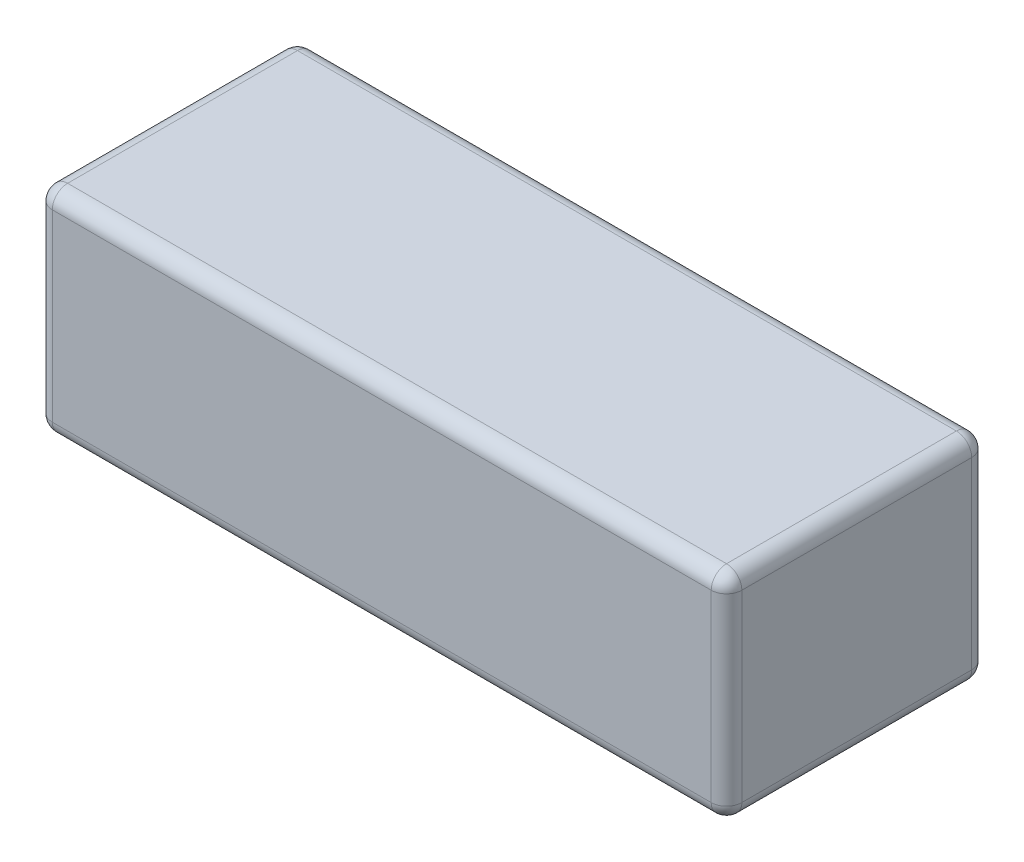
ISO-10303-21;
HEADER;
FILE_DESCRIPTION(('STEP AP214'),'2;1');
FILE_NAME('part.step','',(''),(''),'','','');
FILE_SCHEMA(('AUTOMOTIVE_DESIGN { 1 0 10303 214 1 1 1 1 }'));
ENDSEC;
DATA;
#1=APPLICATION_CONTEXT('core data for automotive mechanical design processes');
#2=APPLICATION_PROTOCOL_DEFINITION('international standard','automotive_design',2000,#1);
#3=PRODUCT_CONTEXT('',#1,'mechanical');
#4=PRODUCT('Part','Part','',(#3));
#5=PRODUCT_RELATED_PRODUCT_CATEGORY('part','',(#4));
#6=PRODUCT_DEFINITION_FORMATION('','',#4);
#7=PRODUCT_DEFINITION_CONTEXT('part definition',#1,'design');
#8=PRODUCT_DEFINITION('design','',#6,#7);
#9=PRODUCT_DEFINITION_SHAPE('','',#8);
#10=(LENGTH_UNIT() NAMED_UNIT(*) SI_UNIT(.MILLI.,.METRE.));
#11=(NAMED_UNIT(*) PLANE_ANGLE_UNIT() SI_UNIT($,.RADIAN.));
#12=(NAMED_UNIT(*) SI_UNIT($,.STERADIAN.) SOLID_ANGLE_UNIT());
#13=UNCERTAINTY_MEASURE_WITH_UNIT(LENGTH_MEASURE(1.E-05),#10,'distance_accuracy_value','');
#14=(GEOMETRIC_REPRESENTATION_CONTEXT(3) GLOBAL_UNCERTAINTY_ASSIGNED_CONTEXT((#13)) GLOBAL_UNIT_ASSIGNED_CONTEXT((#10,
#11,#12)) REPRESENTATION_CONTEXT('',''));
#15=CARTESIAN_POINT('',(0.,0.,0.));
#16=DIRECTION('',(0.,0.,1.));
#17=DIRECTION('',(1.,0.,0.));
#18=AXIS2_PLACEMENT_3D('',#15,#16,#17);
#19=CARTESIAN_POINT('',(45.,28.,-17.));
#20=DIRECTION('',(-1.,0.,0.));
#21=DIRECTION('',(0.,0.,1.));
#22=AXIS2_PLACEMENT_3D('',#19,#20,#21);
#23=PLANE('',#22);
#24=DIRECTION('',(0.,0.,-1.));
#25=VECTOR('',#24,1.);
#26=CARTESIAN_POINT('',(45.,26.,17.));
#27=LINE('',#26,#25);
#28=CARTESIAN_POINT('',(45.,26.,-15.));
#29=VERTEX_POINT('',#28);
#30=CARTESIAN_POINT('',(45.,26.,15.));
#31=VERTEX_POINT('',#30);
#32=EDGE_CURVE('E140',#29,#31,#27,.F.);
#33=ORIENTED_EDGE('',*,*,#32,.T.);
#34=DIRECTION('',(0.,-1.,0.));
#35=VECTOR('',#34,1.);
#36=CARTESIAN_POINT('',(45.,28.,15.));
#37=LINE('',#36,#35);
#38=CARTESIAN_POINT('',(45.,2.,15.));
#39=VERTEX_POINT('',#38);
#40=EDGE_CURVE('E135',#31,#39,#37,.T.);
#41=ORIENTED_EDGE('',*,*,#40,.T.);
#42=DIRECTION('',(0.,0.,-1.));
#43=VECTOR('',#42,1.);
#44=CARTESIAN_POINT('',(45.,2.,-17.));
#45=LINE('',#44,#43);
#46=CARTESIAN_POINT('',(45.,2.,-15.));
#47=VERTEX_POINT('',#46);
#48=EDGE_CURVE('E130',#39,#47,#45,.T.);
#49=ORIENTED_EDGE('',*,*,#48,.T.);
#50=DIRECTION('',(0.,-1.,0.));
#51=VECTOR('',#50,1.);
#52=CARTESIAN_POINT('',(45.,28.,-15.));
#53=LINE('',#52,#51);
#54=EDGE_CURVE('E132',#47,#29,#53,.F.);
#55=ORIENTED_EDGE('',*,*,#54,.T.);
#56=EDGE_LOOP('',(#33,#41,#49,#55));
#57=FACE_BOUND('',#56,.T.);
#58=ADVANCED_FACE('F40',(#57),#23,.F.);
#59=CARTESIAN_POINT('',(-45.,28.,-17.));
#60=DIRECTION('',(0.,0.,1.));
#61=DIRECTION('',(1.,0.,0.));
#62=AXIS2_PLACEMENT_3D('',#59,#60,#61);
#63=PLANE('',#62);
#64=DIRECTION('',(-1.,0.,0.));
#65=VECTOR('',#64,1.);
#66=CARTESIAN_POINT('',(45.,26.,-17.));
#67=LINE('',#66,#65);
#68=CARTESIAN_POINT('',(-43.,26.,-17.));
#69=VERTEX_POINT('',#68);
#70=CARTESIAN_POINT('',(43.,26.,-17.));
#71=VERTEX_POINT('',#70);
#72=EDGE_CURVE('E50',#69,#71,#67,.F.);
#73=ORIENTED_EDGE('',*,*,#72,.T.);
#74=DIRECTION('',(0.,-1.,0.));
#75=VECTOR('',#74,1.);
#76=CARTESIAN_POINT('',(43.,28.,-17.));
#77=LINE('',#76,#75);
#78=CARTESIAN_POINT('',(43.,2.,-17.));
#79=VERTEX_POINT('',#78);
#80=EDGE_CURVE('E11',#71,#79,#77,.T.);
#81=ORIENTED_EDGE('',*,*,#80,.T.);
#82=DIRECTION('',(-1.,0.,0.));
#83=VECTOR('',#82,1.);
#84=CARTESIAN_POINT('',(-45.,2.,-17.));
#85=LINE('',#84,#83);
#86=CARTESIAN_POINT('',(-43.,2.,-17.));
#87=VERTEX_POINT('',#86);
#88=EDGE_CURVE('E250',#79,#87,#85,.T.);
#89=ORIENTED_EDGE('',*,*,#88,.T.);
#90=DIRECTION('',(0.,-1.,0.));
#91=VECTOR('',#90,1.);
#92=CARTESIAN_POINT('',(-43.,28.,-17.));
#93=LINE('',#92,#91);
#94=EDGE_CURVE('E61',#87,#69,#93,.F.);
#95=ORIENTED_EDGE('',*,*,#94,.T.);
#96=EDGE_LOOP('',(#73,#81,#89,#95));
#97=FACE_BOUND('',#96,.T.);
#98=ADVANCED_FACE('F373',(#97),#63,.F.);
#99=CARTESIAN_POINT('',(-45.,28.,-17.));
#100=DIRECTION('',(1.,0.,0.));
#101=DIRECTION('',(0.,0.,-1.));
#102=AXIS2_PLACEMENT_3D('',#99,#100,#101);
#103=PLANE('',#102);
#104=DIRECTION('',(0.,0.,1.));
#105=VECTOR('',#104,1.);
#106=CARTESIAN_POINT('',(-45.,2.,-17.));
#107=LINE('',#106,#105);
#108=CARTESIAN_POINT('',(-45.,2.,-15.));
#109=VERTEX_POINT('',#108);
#110=CARTESIAN_POINT('',(-45.,2.,15.));
#111=VERTEX_POINT('',#110);
#112=EDGE_CURVE('E328',#109,#111,#107,.T.);
#113=ORIENTED_EDGE('',*,*,#112,.T.);
#114=DIRECTION('',(0.,-1.,0.));
#115=VECTOR('',#114,1.);
#116=CARTESIAN_POINT('',(-45.,28.,15.));
#117=LINE('',#116,#115);
#118=CARTESIAN_POINT('',(-45.,26.,15.));
#119=VERTEX_POINT('',#118);
#120=EDGE_CURVE('E331',#111,#119,#117,.F.);
#121=ORIENTED_EDGE('',*,*,#120,.T.);
#122=DIRECTION('',(0.,0.,1.));
#123=VECTOR('',#122,1.);
#124=CARTESIAN_POINT('',(-45.,26.,-17.));
#125=LINE('',#124,#123);
#126=CARTESIAN_POINT('',(-45.,26.,-15.));
#127=VERTEX_POINT('',#126);
#128=EDGE_CURVE('E238',#119,#127,#125,.F.);
#129=ORIENTED_EDGE('',*,*,#128,.T.);
#130=DIRECTION('',(0.,-1.,0.));
#131=VECTOR('',#130,1.);
#132=CARTESIAN_POINT('',(-45.,28.,-15.));
#133=LINE('',#132,#131);
#134=EDGE_CURVE('E323',#127,#109,#133,.T.);
#135=ORIENTED_EDGE('',*,*,#134,.T.);
#136=EDGE_LOOP('',(#113,#121,#129,#135));
#137=FACE_BOUND('',#136,.T.);
#138=ADVANCED_FACE('F377',(#137),#103,.F.);
#139=CARTESIAN_POINT('',(-45.,28.,17.));
#140=DIRECTION('',(0.,0.,-1.));
#141=DIRECTION('',(-1.,0.,0.));
#142=AXIS2_PLACEMENT_3D('',#139,#140,#141);
#143=PLANE('',#142);
#144=DIRECTION('',(1.,0.,0.));
#145=VECTOR('',#144,1.);
#146=CARTESIAN_POINT('',(-45.,2.,17.));
#147=LINE('',#146,#145);
#148=CARTESIAN_POINT('',(-43.,2.,17.));
#149=VERTEX_POINT('',#148);
#150=CARTESIAN_POINT('',(43.,2.,17.));
#151=VERTEX_POINT('',#150);
#152=EDGE_CURVE('E301',#149,#151,#147,.T.);
#153=ORIENTED_EDGE('',*,*,#152,.T.);
#154=DIRECTION('',(0.,-1.,0.));
#155=VECTOR('',#154,1.);
#156=CARTESIAN_POINT('',(43.,28.,17.));
#157=LINE('',#156,#155);
#158=CARTESIAN_POINT('',(43.,26.,17.));
#159=VERTEX_POINT('',#158);
#160=EDGE_CURVE('E298',#151,#159,#157,.F.);
#161=ORIENTED_EDGE('',*,*,#160,.T.);
#162=DIRECTION('',(1.,0.,0.));
#163=VECTOR('',#162,1.);
#164=CARTESIAN_POINT('',(-45.,26.,17.));
#165=LINE('',#164,#163);
#166=CARTESIAN_POINT('',(-43.,26.,17.));
#167=VERTEX_POINT('',#166);
#168=EDGE_CURVE('E289',#159,#167,#165,.F.);
#169=ORIENTED_EDGE('',*,*,#168,.T.);
#170=DIRECTION('',(0.,-1.,0.));
#171=VECTOR('',#170,1.);
#172=CARTESIAN_POINT('',(-43.,28.,17.));
#173=LINE('',#172,#171);
#174=EDGE_CURVE('E295',#167,#149,#173,.T.);
#175=ORIENTED_EDGE('',*,*,#174,.T.);
#176=EDGE_LOOP('',(#153,#161,#169,#175));
#177=FACE_BOUND('',#176,.T.);
#178=ADVANCED_FACE('F299',(#177),#143,.F.);
#179=CARTESIAN_POINT('',(0.,28.,0.));
#180=DIRECTION('',(0.,1.,0.));
#181=DIRECTION('',(0.,0.,1.));
#182=AXIS2_PLACEMENT_3D('',#179,#180,#181);
#183=PLANE('',#182);
#184=DIRECTION('',(0.,0.,1.));
#185=VECTOR('',#184,1.);
#186=CARTESIAN_POINT('',(-43.,28.,17.));
#187=LINE('',#186,#185);
#188=CARTESIAN_POINT('',(-43.,28.,-15.));
#189=VERTEX_POINT('',#188);
#190=CARTESIAN_POINT('',(-43.,28.,15.));
#191=VERTEX_POINT('',#190);
#192=EDGE_CURVE('E240',#189,#191,#187,.T.);
#193=ORIENTED_EDGE('',*,*,#192,.T.);
#194=DIRECTION('',(1.,0.,0.));
#195=VECTOR('',#194,1.);
#196=CARTESIAN_POINT('',(45.,28.,15.));
#197=LINE('',#196,#195);
#198=CARTESIAN_POINT('',(43.,28.,15.));
#199=VERTEX_POINT('',#198);
#200=EDGE_CURVE('E245',#191,#199,#197,.T.);
#201=ORIENTED_EDGE('',*,*,#200,.T.);
#202=DIRECTION('',(0.,0.,-1.));
#203=VECTOR('',#202,1.);
#204=CARTESIAN_POINT('',(43.,28.,-17.));
#205=LINE('',#204,#203);
#206=CARTESIAN_POINT('',(43.,28.,-15.));
#207=VERTEX_POINT('',#206);
#208=EDGE_CURVE('E246',#199,#207,#205,.T.);
#209=ORIENTED_EDGE('',*,*,#208,.T.);
#210=DIRECTION('',(-1.,0.,0.));
#211=VECTOR('',#210,1.);
#212=CARTESIAN_POINT('',(-45.,28.,-15.));
#213=LINE('',#212,#211);
#214=EDGE_CURVE('E252',#207,#189,#213,.T.);
#215=ORIENTED_EDGE('',*,*,#214,.T.);
#216=EDGE_LOOP('',(#193,#201,#209,#215));
#217=FACE_BOUND('',#216,.T.);
#218=ADVANCED_FACE('F335',(#217),#183,.T.);
#219=CARTESIAN_POINT('',(0.,0.,0.));
#220=DIRECTION('',(0.,1.,0.));
#221=DIRECTION('',(0.,0.,1.));
#222=AXIS2_PLACEMENT_3D('',#219,#220,#221);
#223=PLANE('',#222);
#224=DIRECTION('',(0.,0.,-1.));
#225=VECTOR('',#224,1.);
#226=CARTESIAN_POINT('',(43.,0.,0.));
#227=LINE('',#226,#225);
#228=CARTESIAN_POINT('',(43.,0.,-15.));
#229=VERTEX_POINT('',#228);
#230=CARTESIAN_POINT('',(43.,0.,15.));
#231=VERTEX_POINT('',#230);
#232=EDGE_CURVE('E163',#229,#231,#227,.F.);
#233=ORIENTED_EDGE('',*,*,#232,.T.);
#234=DIRECTION('',(1.,0.,0.));
#235=VECTOR('',#234,1.);
#236=CARTESIAN_POINT('',(0.,0.,15.));
#237=LINE('',#236,#235);
#238=CARTESIAN_POINT('',(-43.,0.,15.));
#239=VERTEX_POINT('',#238);
#240=EDGE_CURVE('E319',#231,#239,#237,.F.);
#241=ORIENTED_EDGE('',*,*,#240,.T.);
#242=DIRECTION('',(0.,0.,1.));
#243=VECTOR('',#242,1.);
#244=CARTESIAN_POINT('',(-43.,0.,0.));
#245=LINE('',#244,#243);
#246=CARTESIAN_POINT('',(-43.,0.,-15.));
#247=VERTEX_POINT('',#246);
#248=EDGE_CURVE('E310',#239,#247,#245,.F.);
#249=ORIENTED_EDGE('',*,*,#248,.T.);
#250=DIRECTION('',(-1.,0.,0.));
#251=VECTOR('',#250,1.);
#252=CARTESIAN_POINT('',(0.,0.,-15.));
#253=LINE('',#252,#251);
#254=EDGE_CURVE('E306',#247,#229,#253,.F.);
#255=ORIENTED_EDGE('',*,*,#254,.T.);
#256=EDGE_LOOP('',(#233,#241,#249,#255));
#257=FACE_BOUND('',#256,.T.);
#258=ADVANCED_FACE('F385',(#257),#223,.F.);
#259=CARTESIAN_POINT('',(-43.,28.,-15.));
#260=DIRECTION('',(0.,-1.,0.));
#261=DIRECTION('',(0.,0.,-1.));
#262=AXIS2_PLACEMENT_3D('',#259,#260,#261);
#263=CYLINDRICAL_SURFACE('',#262,2.);
#264=CARTESIAN_POINT('',(-43.,26.,-15.));
#265=DIRECTION('',(0.,1.,0.));
#266=DIRECTION('',(0.,0.,1.));
#267=AXIS2_PLACEMENT_3D('',#264,#265,#266);
#268=CIRCLE('',#267,2.);
#269=EDGE_CURVE('E44',#69,#127,#268,.T.);
#270=ORIENTED_EDGE('',*,*,#269,.F.);
#271=ORIENTED_EDGE('',*,*,#94,.F.);
#272=CARTESIAN_POINT('',(-43.,2.,-15.));
#273=DIRECTION('',(0.,-1.,0.));
#274=DIRECTION('',(0.,0.,-1.));
#275=AXIS2_PLACEMENT_3D('',#272,#273,#274);
#276=CIRCLE('',#275,2.);
#277=EDGE_CURVE('E218',#109,#87,#276,.T.);
#278=ORIENTED_EDGE('',*,*,#277,.F.);
#279=ORIENTED_EDGE('',*,*,#134,.F.);
#280=EDGE_LOOP('',(#270,#271,#278,#279));
#281=FACE_BOUND('',#280,.T.);
#282=ADVANCED_FACE('F42',(#281),#263,.T.);
#283=CARTESIAN_POINT('',(-43.,26.,-15.));
#284=DIRECTION('',(-1.,0.,0.));
#285=DIRECTION('',(0.,0.,1.));
#286=AXIS2_PLACEMENT_3D('',#283,#284,#285);
#287=SPHERICAL_SURFACE('',#286,2.);
#288=CARTESIAN_POINT('',(-43.,26.,-15.));
#289=DIRECTION('',(-1.,0.,0.));
#290=DIRECTION('',(0.,0.,1.));
#291=AXIS2_PLACEMENT_3D('',#288,#289,#290);
#292=CIRCLE('',#291,2.);
#293=EDGE_CURVE('E211',#69,#189,#292,.F.);
#294=ORIENTED_EDGE('',*,*,#293,.F.);
#295=ORIENTED_EDGE('',*,*,#269,.T.);
#296=CARTESIAN_POINT('',(-43.,26.,-15.));
#297=DIRECTION('',(0.,0.,-1.));
#298=DIRECTION('',(-1.,0.,0.));
#299=AXIS2_PLACEMENT_3D('',#296,#297,#298);
#300=CIRCLE('',#299,2.);
#301=EDGE_CURVE('E215',#189,#127,#300,.F.);
#302=ORIENTED_EDGE('',*,*,#301,.F.);
#303=EDGE_LOOP('',(#294,#295,#302));
#304=FACE_BOUND('',#303,.T.);
#305=ADVANCED_FACE('F230',(#304),#287,.T.);
#306=CARTESIAN_POINT('',(-43.,2.,-15.));
#307=DIRECTION('',(0.,0.,-1.));
#308=DIRECTION('',(0.,1.,0.));
#309=AXIS2_PLACEMENT_3D('',#306,#307,#308);
#310=SPHERICAL_SURFACE('',#309,2.);
#311=CARTESIAN_POINT('',(-43.,2.,-15.));
#312=DIRECTION('',(0.,0.,-1.));
#313=DIRECTION('',(-1.,0.,0.));
#314=AXIS2_PLACEMENT_3D('',#311,#312,#313);
#315=CIRCLE('',#314,2.);
#316=EDGE_CURVE('E203',#109,#247,#315,.F.);
#317=ORIENTED_EDGE('',*,*,#316,.F.);
#318=ORIENTED_EDGE('',*,*,#277,.T.);
#319=CARTESIAN_POINT('',(-43.,2.,-15.));
#320=DIRECTION('',(-1.,0.,0.));
#321=DIRECTION('',(0.,0.,1.));
#322=AXIS2_PLACEMENT_3D('',#319,#320,#321);
#323=CIRCLE('',#322,2.);
#324=EDGE_CURVE('E207',#247,#87,#323,.F.);
#325=ORIENTED_EDGE('',*,*,#324,.F.);
#326=EDGE_LOOP('',(#317,#318,#325));
#327=FACE_BOUND('',#326,.T.);
#328=ADVANCED_FACE('F410',(#327),#310,.T.);
#329=CARTESIAN_POINT('',(-43.,26.,0.));
#330=DIRECTION('',(0.,0.,-1.));
#331=DIRECTION('',(-1.,0.,0.));
#332=AXIS2_PLACEMENT_3D('',#329,#330,#331);
#333=CYLINDRICAL_SURFACE('',#332,2.);
#334=ORIENTED_EDGE('',*,*,#301,.T.);
#335=ORIENTED_EDGE('',*,*,#128,.F.);
#336=CARTESIAN_POINT('',(-43.,26.,15.));
#337=DIRECTION('',(0.,0.,1.));
#338=DIRECTION('',(1.,0.,0.));
#339=AXIS2_PLACEMENT_3D('',#336,#337,#338);
#340=CIRCLE('',#339,2.);
#341=EDGE_CURVE('E196',#191,#119,#340,.T.);
#342=ORIENTED_EDGE('',*,*,#341,.F.);
#343=ORIENTED_EDGE('',*,*,#192,.F.);
#344=EDGE_LOOP('',(#334,#335,#342,#343));
#345=FACE_BOUND('',#344,.T.);
#346=ADVANCED_FACE('F236',(#345),#333,.T.);
#347=CARTESIAN_POINT('',(0.,26.,-15.));
#348=DIRECTION('',(1.,0.,0.));
#349=DIRECTION('',(0.,0.,-1.));
#350=AXIS2_PLACEMENT_3D('',#347,#348,#349);
#351=CYLINDRICAL_SURFACE('',#350,2.);
#352=ORIENTED_EDGE('',*,*,#293,.T.);
#353=ORIENTED_EDGE('',*,*,#214,.F.);
#354=CARTESIAN_POINT('',(43.,26.,-15.));
#355=DIRECTION('',(1.,0.,0.));
#356=DIRECTION('',(0.,1.,0.));
#357=AXIS2_PLACEMENT_3D('',#354,#355,#356);
#358=CIRCLE('',#357,2.);
#359=EDGE_CURVE('E192',#71,#207,#358,.T.);
#360=ORIENTED_EDGE('',*,*,#359,.F.);
#361=ORIENTED_EDGE('',*,*,#72,.F.);
#362=EDGE_LOOP('',(#352,#353,#360,#361));
#363=FACE_BOUND('',#362,.T.);
#364=ADVANCED_FACE('F338',(#363),#351,.T.);
#365=CARTESIAN_POINT('',(43.,28.,-15.));
#366=DIRECTION('',(0.,-1.,0.));
#367=DIRECTION('',(0.,0.,-1.));
#368=AXIS2_PLACEMENT_3D('',#365,#366,#367);
#369=CYLINDRICAL_SURFACE('',#368,2.);
#370=CARTESIAN_POINT('',(43.,2.,-15.));
#371=DIRECTION('',(0.,-1.,0.));
#372=DIRECTION('',(0.,0.,-1.));
#373=AXIS2_PLACEMENT_3D('',#370,#371,#372);
#374=CIRCLE('',#373,2.);
#375=EDGE_CURVE('E146',#79,#47,#374,.T.);
#376=ORIENTED_EDGE('',*,*,#375,.F.);
#377=ORIENTED_EDGE('',*,*,#80,.F.);
#378=CARTESIAN_POINT('',(43.,26.,-15.));
#379=DIRECTION('',(0.,1.,0.));
#380=DIRECTION('',(0.,0.,1.));
#381=AXIS2_PLACEMENT_3D('',#378,#379,#380);
#382=CIRCLE('',#381,2.);
#383=EDGE_CURVE('E149',#29,#71,#382,.T.);
#384=ORIENTED_EDGE('',*,*,#383,.F.);
#385=ORIENTED_EDGE('',*,*,#54,.F.);
#386=EDGE_LOOP('',(#376,#377,#384,#385));
#387=FACE_BOUND('',#386,.T.);
#388=ADVANCED_FACE('F145',(#387),#369,.T.);
#389=CARTESIAN_POINT('',(-45.,2.,-15.));
#390=DIRECTION('',(-1.,0.,0.));
#391=DIRECTION('',(0.,0.,1.));
#392=AXIS2_PLACEMENT_3D('',#389,#390,#391);
#393=CYLINDRICAL_SURFACE('',#392,2.);
#394=ORIENTED_EDGE('',*,*,#324,.T.);
#395=ORIENTED_EDGE('',*,*,#88,.F.);
#396=CARTESIAN_POINT('',(43.,2.,-15.));
#397=DIRECTION('',(1.,0.,0.));
#398=DIRECTION('',(0.,0.,-1.));
#399=AXIS2_PLACEMENT_3D('',#396,#397,#398);
#400=CIRCLE('',#399,2.);
#401=EDGE_CURVE('E159',#229,#79,#400,.T.);
#402=ORIENTED_EDGE('',*,*,#401,.F.);
#403=ORIENTED_EDGE('',*,*,#254,.F.);
#404=EDGE_LOOP('',(#394,#395,#402,#403));
#405=FACE_BOUND('',#404,.T.);
#406=ADVANCED_FACE('F437',(#405),#393,.T.);
#407=CARTESIAN_POINT('',(-43.,2.,-17.));
#408=DIRECTION('',(0.,0.,1.));
#409=DIRECTION('',(1.,0.,0.));
#410=AXIS2_PLACEMENT_3D('',#407,#408,#409);
#411=CYLINDRICAL_SURFACE('',#410,2.);
#412=ORIENTED_EDGE('',*,*,#316,.T.);
#413=ORIENTED_EDGE('',*,*,#248,.F.);
#414=CARTESIAN_POINT('',(-43.,2.,15.));
#415=DIRECTION('',(0.,0.,1.));
#416=DIRECTION('',(1.,0.,0.));
#417=AXIS2_PLACEMENT_3D('',#414,#415,#416);
#418=CIRCLE('',#417,2.);
#419=EDGE_CURVE('E184',#111,#239,#418,.T.);
#420=ORIENTED_EDGE('',*,*,#419,.F.);
#421=ORIENTED_EDGE('',*,*,#112,.F.);
#422=EDGE_LOOP('',(#412,#413,#420,#421));
#423=FACE_BOUND('',#422,.T.);
#424=ADVANCED_FACE('F446',(#423),#411,.T.);
#425=CARTESIAN_POINT('',(-43.,28.,15.));
#426=DIRECTION('',(0.,-1.,0.));
#427=DIRECTION('',(0.,0.,-1.));
#428=AXIS2_PLACEMENT_3D('',#425,#426,#427);
#429=CYLINDRICAL_SURFACE('',#428,2.);
#430=CARTESIAN_POINT('',(-43.,26.,15.));
#431=DIRECTION('',(0.,1.,0.));
#432=DIRECTION('',(0.,0.,1.));
#433=AXIS2_PLACEMENT_3D('',#430,#431,#432);
#434=CIRCLE('',#433,2.);
#435=EDGE_CURVE('E199',#119,#167,#434,.T.);
#436=ORIENTED_EDGE('',*,*,#435,.F.);
#437=ORIENTED_EDGE('',*,*,#120,.F.);
#438=CARTESIAN_POINT('',(-43.,2.,15.));
#439=DIRECTION('',(0.,-1.,0.));
#440=DIRECTION('',(0.,0.,-1.));
#441=AXIS2_PLACEMENT_3D('',#438,#439,#440);
#442=CIRCLE('',#441,2.);
#443=EDGE_CURVE('E180',#149,#111,#442,.T.);
#444=ORIENTED_EDGE('',*,*,#443,.F.);
#445=ORIENTED_EDGE('',*,*,#174,.F.);
#446=EDGE_LOOP('',(#436,#437,#444,#445));
#447=FACE_BOUND('',#446,.T.);
#448=ADVANCED_FACE('F354',(#447),#429,.T.);
#449=CARTESIAN_POINT('',(-43.,26.,15.));
#450=DIRECTION('',(-1.,0.,0.));
#451=DIRECTION('',(0.,0.,1.));
#452=AXIS2_PLACEMENT_3D('',#449,#450,#451);
#453=SPHERICAL_SURFACE('',#452,2.);
#454=ORIENTED_EDGE('',*,*,#341,.T.);
#455=ORIENTED_EDGE('',*,*,#435,.T.);
#456=CARTESIAN_POINT('',(-43.,26.,15.));
#457=DIRECTION('',(-1.,0.,0.));
#458=DIRECTION('',(0.,0.,1.));
#459=AXIS2_PLACEMENT_3D('',#456,#457,#458);
#460=CIRCLE('',#459,2.);
#461=EDGE_CURVE('E171',#191,#167,#460,.F.);
#462=ORIENTED_EDGE('',*,*,#461,.F.);
#463=EDGE_LOOP('',(#454,#455,#462));
#464=FACE_BOUND('',#463,.T.);
#465=ADVANCED_FACE('F461',(#464),#453,.T.);
#466=CARTESIAN_POINT('',(43.,26.,-15.));
#467=DIRECTION('',(0.,0.,-1.));
#468=DIRECTION('',(-1.,0.,0.));
#469=AXIS2_PLACEMENT_3D('',#466,#467,#468);
#470=SPHERICAL_SURFACE('',#469,2.);
#471=ORIENTED_EDGE('',*,*,#383,.T.);
#472=ORIENTED_EDGE('',*,*,#359,.T.);
#473=CARTESIAN_POINT('',(43.,26.,-15.));
#474=DIRECTION('',(0.,0.,-1.));
#475=DIRECTION('',(-1.,0.,0.));
#476=AXIS2_PLACEMENT_3D('',#473,#474,#475);
#477=CIRCLE('',#476,2.);
#478=EDGE_CURVE('E165',#29,#207,#477,.F.);
#479=ORIENTED_EDGE('',*,*,#478,.F.);
#480=EDGE_LOOP('',(#471,#472,#479));
#481=FACE_BOUND('',#480,.T.);
#482=ADVANCED_FACE('F340',(#481),#470,.T.);
#483=CARTESIAN_POINT('',(43.,2.,-15.));
#484=DIRECTION('',(0.,0.,-1.));
#485=DIRECTION('',(0.,1.,0.));
#486=AXIS2_PLACEMENT_3D('',#483,#484,#485);
#487=SPHERICAL_SURFACE('',#486,2.);
#488=ORIENTED_EDGE('',*,*,#401,.T.);
#489=ORIENTED_EDGE('',*,*,#375,.T.);
#490=CARTESIAN_POINT('',(43.,2.,-15.));
#491=DIRECTION('',(0.,0.,-1.));
#492=DIRECTION('',(-1.,0.,0.));
#493=AXIS2_PLACEMENT_3D('',#490,#491,#492);
#494=CIRCLE('',#493,2.);
#495=EDGE_CURVE('E156',#229,#47,#494,.F.);
#496=ORIENTED_EDGE('',*,*,#495,.F.);
#497=EDGE_LOOP('',(#488,#489,#496));
#498=FACE_BOUND('',#497,.T.);
#499=ADVANCED_FACE('F155',(#498),#487,.T.);
#500=CARTESIAN_POINT('',(-43.,2.,15.));
#501=DIRECTION('',(-1.,0.,0.));
#502=DIRECTION('',(0.,-1.,0.));
#503=AXIS2_PLACEMENT_3D('',#500,#501,#502);
#504=SPHERICAL_SURFACE('',#503,2.);
#505=ORIENTED_EDGE('',*,*,#443,.T.);
#506=ORIENTED_EDGE('',*,*,#419,.T.);
#507=CARTESIAN_POINT('',(-43.,2.,15.));
#508=DIRECTION('',(-1.,0.,0.));
#509=DIRECTION('',(0.,0.,1.));
#510=AXIS2_PLACEMENT_3D('',#507,#508,#509);
#511=CIRCLE('',#510,2.);
#512=EDGE_CURVE('E166',#149,#239,#511,.F.);
#513=ORIENTED_EDGE('',*,*,#512,.F.);
#514=EDGE_LOOP('',(#505,#506,#513));
#515=FACE_BOUND('',#514,.T.);
#516=ADVANCED_FACE('F357',(#515),#504,.T.);
#517=CARTESIAN_POINT('',(0.,26.,15.));
#518=DIRECTION('',(-1.,0.,0.));
#519=DIRECTION('',(0.,0.,1.));
#520=AXIS2_PLACEMENT_3D('',#517,#518,#519);
#521=CYLINDRICAL_SURFACE('',#520,2.);
#522=ORIENTED_EDGE('',*,*,#461,.T.);
#523=ORIENTED_EDGE('',*,*,#168,.F.);
#524=CARTESIAN_POINT('',(43.,26.,15.));
#525=DIRECTION('',(1.,0.,0.));
#526=DIRECTION('',(0.,0.,-1.));
#527=AXIS2_PLACEMENT_3D('',#524,#525,#526);
#528=CIRCLE('',#527,2.);
#529=EDGE_CURVE('E173',#199,#159,#528,.T.);
#530=ORIENTED_EDGE('',*,*,#529,.F.);
#531=ORIENTED_EDGE('',*,*,#200,.F.);
#532=EDGE_LOOP('',(#522,#523,#530,#531));
#533=FACE_BOUND('',#532,.T.);
#534=ADVANCED_FACE('F291',(#533),#521,.T.);
#535=CARTESIAN_POINT('',(43.,26.,0.));
#536=DIRECTION('',(0.,0.,1.));
#537=DIRECTION('',(1.,0.,0.));
#538=AXIS2_PLACEMENT_3D('',#535,#536,#537);
#539=CYLINDRICAL_SURFACE('',#538,2.);
#540=ORIENTED_EDGE('',*,*,#478,.T.);
#541=ORIENTED_EDGE('',*,*,#208,.F.);
#542=CARTESIAN_POINT('',(43.,26.,15.));
#543=DIRECTION('',(0.,0.,1.));
#544=DIRECTION('',(0.,-1.,0.));
#545=AXIS2_PLACEMENT_3D('',#542,#543,#544);
#546=CIRCLE('',#545,2.);
#547=EDGE_CURVE('E276',#31,#199,#546,.T.);
#548=ORIENTED_EDGE('',*,*,#547,.F.);
#549=ORIENTED_EDGE('',*,*,#32,.F.);
#550=EDGE_LOOP('',(#540,#541,#548,#549));
#551=FACE_BOUND('',#550,.T.);
#552=ADVANCED_FACE('F343',(#551),#539,.T.);
#553=CARTESIAN_POINT('',(43.,2.,-17.));
#554=DIRECTION('',(0.,0.,-1.));
#555=DIRECTION('',(-1.,0.,0.));
#556=AXIS2_PLACEMENT_3D('',#553,#554,#555);
#557=CYLINDRICAL_SURFACE('',#556,2.);
#558=ORIENTED_EDGE('',*,*,#495,.T.);
#559=ORIENTED_EDGE('',*,*,#48,.F.);
#560=CARTESIAN_POINT('',(43.,2.,15.));
#561=DIRECTION('',(0.,0.,1.));
#562=DIRECTION('',(1.,0.,0.));
#563=AXIS2_PLACEMENT_3D('',#560,#561,#562);
#564=CIRCLE('',#563,2.);
#565=EDGE_CURVE('E272',#231,#39,#564,.T.);
#566=ORIENTED_EDGE('',*,*,#565,.F.);
#567=ORIENTED_EDGE('',*,*,#232,.F.);
#568=EDGE_LOOP('',(#558,#559,#566,#567));
#569=FACE_BOUND('',#568,.T.);
#570=ADVANCED_FACE('F162',(#569),#557,.T.);
#571=CARTESIAN_POINT('',(-45.,2.,15.));
#572=DIRECTION('',(1.,0.,0.));
#573=DIRECTION('',(0.,0.,-1.));
#574=AXIS2_PLACEMENT_3D('',#571,#572,#573);
#575=CYLINDRICAL_SURFACE('',#574,2.);
#576=ORIENTED_EDGE('',*,*,#512,.T.);
#577=ORIENTED_EDGE('',*,*,#240,.F.);
#578=CARTESIAN_POINT('',(43.,2.,15.));
#579=DIRECTION('',(1.,0.,0.));
#580=DIRECTION('',(0.,0.,-1.));
#581=AXIS2_PLACEMENT_3D('',#578,#579,#580);
#582=CIRCLE('',#581,2.);
#583=EDGE_CURVE('E268',#151,#231,#582,.T.);
#584=ORIENTED_EDGE('',*,*,#583,.F.);
#585=ORIENTED_EDGE('',*,*,#152,.F.);
#586=EDGE_LOOP('',(#576,#577,#584,#585));
#587=FACE_BOUND('',#586,.T.);
#588=ADVANCED_FACE('F361',(#587),#575,.T.);
#589=CARTESIAN_POINT('',(43.,26.,15.));
#590=DIRECTION('',(0.,1.,0.));
#591=DIRECTION('',(-1.,0.,0.));
#592=AXIS2_PLACEMENT_3D('',#589,#590,#591);
#593=SPHERICAL_SURFACE('',#592,2.);
#594=ORIENTED_EDGE('',*,*,#547,.T.);
#595=ORIENTED_EDGE('',*,*,#529,.T.);
#596=CARTESIAN_POINT('',(43.,26.,15.));
#597=DIRECTION('',(0.,1.,0.));
#598=DIRECTION('',(0.,0.,1.));
#599=AXIS2_PLACEMENT_3D('',#596,#597,#598);
#600=CIRCLE('',#599,2.);
#601=EDGE_CURVE('E265',#31,#159,#600,.F.);
#602=ORIENTED_EDGE('',*,*,#601,.F.);
#603=EDGE_LOOP('',(#594,#595,#602));
#604=FACE_BOUND('',#603,.T.);
#605=ADVANCED_FACE('F284',(#604),#593,.T.);
#606=CARTESIAN_POINT('',(43.,2.,15.));
#607=DIRECTION('',(0.,-1.,0.));
#608=DIRECTION('',(0.,0.,-1.));
#609=AXIS2_PLACEMENT_3D('',#606,#607,#608);
#610=SPHERICAL_SURFACE('',#609,2.);
#611=ORIENTED_EDGE('',*,*,#583,.T.);
#612=ORIENTED_EDGE('',*,*,#565,.T.);
#613=CARTESIAN_POINT('',(43.,2.,15.));
#614=DIRECTION('',(0.,-1.,0.));
#615=DIRECTION('',(0.,0.,-1.));
#616=AXIS2_PLACEMENT_3D('',#613,#614,#615);
#617=CIRCLE('',#616,2.);
#618=EDGE_CURVE('E262',#151,#39,#617,.F.);
#619=ORIENTED_EDGE('',*,*,#618,.F.);
#620=EDGE_LOOP('',(#611,#612,#619));
#621=FACE_BOUND('',#620,.T.);
#622=ADVANCED_FACE('F363',(#621),#610,.T.);
#623=CARTESIAN_POINT('',(43.,28.,15.));
#624=DIRECTION('',(0.,-1.,0.));
#625=DIRECTION('',(0.,0.,-1.));
#626=AXIS2_PLACEMENT_3D('',#623,#624,#625);
#627=CYLINDRICAL_SURFACE('',#626,2.);
#628=ORIENTED_EDGE('',*,*,#601,.T.);
#629=ORIENTED_EDGE('',*,*,#160,.F.);
#630=ORIENTED_EDGE('',*,*,#618,.T.);
#631=ORIENTED_EDGE('',*,*,#40,.F.);
#632=EDGE_LOOP('',(#628,#629,#630,#631));
#633=FACE_BOUND('',#632,.T.);
#634=ADVANCED_FACE('F364',(#633),#627,.T.);
#635=CLOSED_SHELL('',(#58,#98,#138,#178,#218,#258,#282,#305,#328,#346,#364,#388,#406,#424,#448,
#465,#482,#499,#516,#534,#552,#570,#588,#605,#622,#634));
#636=MANIFOLD_SOLID_BREP('B2',#635);
#637=ADVANCED_BREP_SHAPE_REPRESENTATION('',(#18,#636),#14);
#638=SHAPE_DEFINITION_REPRESENTATION(#9,#637);
ENDSEC;
END-ISO-10303-21;
